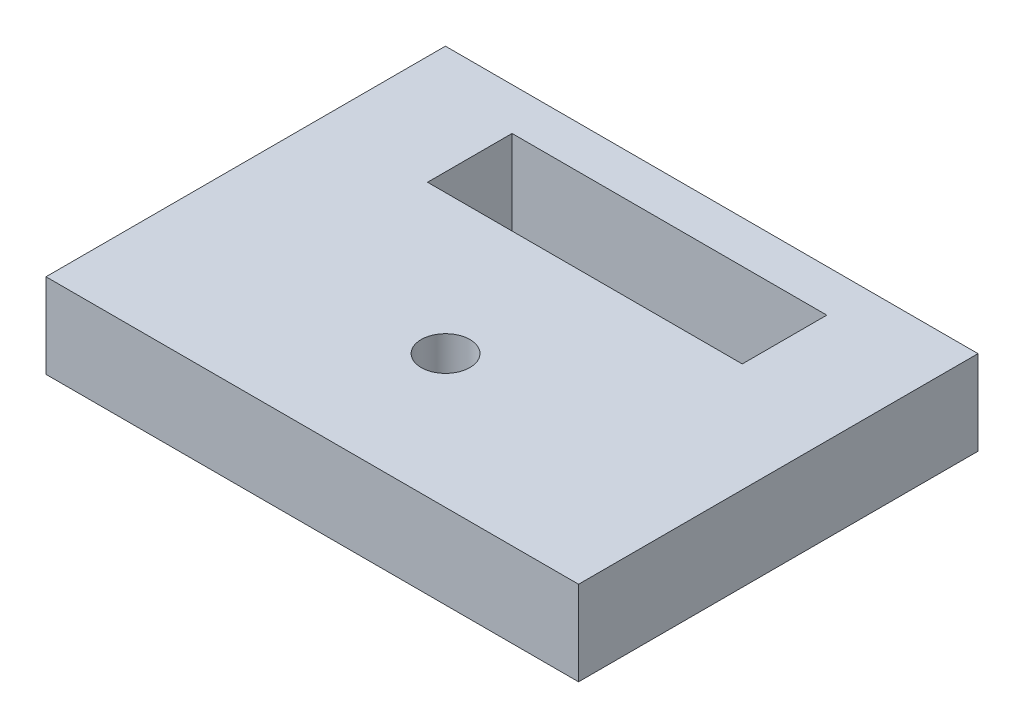
ISO-10303-21;
HEADER;
FILE_DESCRIPTION(('STEP AP214'),'2;1');
FILE_NAME('part.step','',(''),(''),'','','');
FILE_SCHEMA(('AUTOMOTIVE_DESIGN { 1 0 10303 214 1 1 1 1 }'));
ENDSEC;
DATA;
#1=APPLICATION_CONTEXT('core data for automotive mechanical design processes');
#2=APPLICATION_PROTOCOL_DEFINITION('international standard','automotive_design',2000,#1);
#3=PRODUCT_CONTEXT('',#1,'mechanical');
#4=PRODUCT('Part','Part','',(#3));
#5=PRODUCT_RELATED_PRODUCT_CATEGORY('part','',(#4));
#6=PRODUCT_DEFINITION_FORMATION('','',#4);
#7=PRODUCT_DEFINITION_CONTEXT('part definition',#1,'design');
#8=PRODUCT_DEFINITION('design','',#6,#7);
#9=PRODUCT_DEFINITION_SHAPE('','',#8);
#10=(LENGTH_UNIT() NAMED_UNIT(*) SI_UNIT(.MILLI.,.METRE.));
#11=(NAMED_UNIT(*) PLANE_ANGLE_UNIT() SI_UNIT($,.RADIAN.));
#12=(NAMED_UNIT(*) SI_UNIT($,.STERADIAN.) SOLID_ANGLE_UNIT());
#13=UNCERTAINTY_MEASURE_WITH_UNIT(LENGTH_MEASURE(1.E-05),#10,'distance_accuracy_value','');
#14=(GEOMETRIC_REPRESENTATION_CONTEXT(3) GLOBAL_UNCERTAINTY_ASSIGNED_CONTEXT((#13)) GLOBAL_UNIT_ASSIGNED_CONTEXT((#10,
#11,#12)) REPRESENTATION_CONTEXT('',''));
#15=CARTESIAN_POINT('',(0.,0.,0.));
#16=DIRECTION('',(0.,0.,1.));
#17=DIRECTION('',(1.,0.,0.));
#18=AXIS2_PLACEMENT_3D('',#15,#16,#17);
#19=CARTESIAN_POINT('',(-20.,6.35,15.));
#20=DIRECTION('',(0.,0.,-1.));
#21=DIRECTION('',(-1.,0.,0.));
#22=AXIS2_PLACEMENT_3D('',#19,#20,#21);
#23=PLANE('',#22);
#24=DIRECTION('',(1.,0.,0.));
#25=VECTOR('',#24,1.);
#26=CARTESIAN_POINT('',(-20.,0.,15.));
#27=LINE('',#26,#25);
#28=CARTESIAN_POINT('',(-20.,0.,15.));
#29=VERTEX_POINT('',#28);
#30=CARTESIAN_POINT('',(20.,0.,15.));
#31=VERTEX_POINT('',#30);
#32=EDGE_CURVE('E133',#29,#31,#27,.T.);
#33=ORIENTED_EDGE('',*,*,#32,.T.);
#34=DIRECTION('',(0.,-1.,0.));
#35=VECTOR('',#34,1.);
#36=CARTESIAN_POINT('',(20.,6.35,15.));
#37=LINE('',#36,#35);
#38=CARTESIAN_POINT('',(20.,6.35,15.));
#39=VERTEX_POINT('',#38);
#40=EDGE_CURVE('E11',#39,#31,#37,.T.);
#41=ORIENTED_EDGE('',*,*,#40,.F.);
#42=DIRECTION('',(1.,0.,0.));
#43=VECTOR('',#42,1.);
#44=CARTESIAN_POINT('',(-20.,6.35,15.));
#45=LINE('',#44,#43);
#46=CARTESIAN_POINT('',(-20.,6.35,15.));
#47=VERTEX_POINT('',#46);
#48=EDGE_CURVE('E137',#47,#39,#45,.T.);
#49=ORIENTED_EDGE('',*,*,#48,.F.);
#50=DIRECTION('',(0.,-1.,0.));
#51=VECTOR('',#50,1.);
#52=CARTESIAN_POINT('',(-20.,6.35,15.));
#53=LINE('',#52,#51);
#54=EDGE_CURVE('E147',#47,#29,#53,.T.);
#55=ORIENTED_EDGE('',*,*,#54,.T.);
#56=EDGE_LOOP('',(#33,#41,#49,#55));
#57=FACE_BOUND('',#56,.T.);
#58=ADVANCED_FACE('F33',(#57),#23,.F.);
#59=CARTESIAN_POINT('',(20.,6.35,15.));
#60=DIRECTION('',(-1.,0.,0.));
#61=DIRECTION('',(0.,0.,1.));
#62=AXIS2_PLACEMENT_3D('',#59,#60,#61);
#63=PLANE('',#62);
#64=DIRECTION('',(0.,0.,-1.));
#65=VECTOR('',#64,1.);
#66=CARTESIAN_POINT('',(20.,0.,15.));
#67=LINE('',#66,#65);
#68=CARTESIAN_POINT('',(20.,0.,-15.));
#69=VERTEX_POINT('',#68);
#70=EDGE_CURVE('E150',#31,#69,#67,.T.);
#71=ORIENTED_EDGE('',*,*,#70,.T.);
#72=DIRECTION('',(0.,-1.,0.));
#73=VECTOR('',#72,1.);
#74=CARTESIAN_POINT('',(20.,6.35,-15.));
#75=LINE('',#74,#73);
#76=CARTESIAN_POINT('',(20.,6.35,-15.));
#77=VERTEX_POINT('',#76);
#78=EDGE_CURVE('E40',#77,#69,#75,.T.);
#79=ORIENTED_EDGE('',*,*,#78,.F.);
#80=DIRECTION('',(0.,0.,-1.));
#81=VECTOR('',#80,1.);
#82=CARTESIAN_POINT('',(20.,6.35,15.));
#83=LINE('',#82,#81);
#84=EDGE_CURVE('E140',#39,#77,#83,.T.);
#85=ORIENTED_EDGE('',*,*,#84,.F.);
#86=ORIENTED_EDGE('',*,*,#40,.T.);
#87=EDGE_LOOP('',(#71,#79,#85,#86));
#88=FACE_BOUND('',#87,.T.);
#89=ADVANCED_FACE('F178',(#88),#63,.F.);
#90=CARTESIAN_POINT('',(-20.,6.35,-15.));
#91=DIRECTION('',(0.,0.,1.));
#92=DIRECTION('',(1.,0.,0.));
#93=AXIS2_PLACEMENT_3D('',#90,#91,#92);
#94=PLANE('',#93);
#95=DIRECTION('',(-1.,0.,0.));
#96=VECTOR('',#95,1.);
#97=CARTESIAN_POINT('',(-20.,0.,-15.));
#98=LINE('',#97,#96);
#99=CARTESIAN_POINT('',(-20.,0.,-15.));
#100=VERTEX_POINT('',#99);
#101=EDGE_CURVE('E152',#69,#100,#98,.T.);
#102=ORIENTED_EDGE('',*,*,#101,.T.);
#103=DIRECTION('',(0.,-1.,0.));
#104=VECTOR('',#103,1.);
#105=CARTESIAN_POINT('',(-20.,6.35,-15.));
#106=LINE('',#105,#104);
#107=CARTESIAN_POINT('',(-20.,6.35,-15.));
#108=VERTEX_POINT('',#107);
#109=EDGE_CURVE('E157',#108,#100,#106,.T.);
#110=ORIENTED_EDGE('',*,*,#109,.F.);
#111=DIRECTION('',(-1.,0.,0.));
#112=VECTOR('',#111,1.);
#113=CARTESIAN_POINT('',(-20.,6.35,-15.));
#114=LINE('',#113,#112);
#115=EDGE_CURVE('E143',#77,#108,#114,.T.);
#116=ORIENTED_EDGE('',*,*,#115,.F.);
#117=ORIENTED_EDGE('',*,*,#78,.T.);
#118=EDGE_LOOP('',(#102,#110,#116,#117));
#119=FACE_BOUND('',#118,.T.);
#120=ADVANCED_FACE('F164',(#119),#94,.F.);
#121=CARTESIAN_POINT('',(-20.,6.35,15.));
#122=DIRECTION('',(1.,0.,0.));
#123=DIRECTION('',(0.,0.,-1.));
#124=AXIS2_PLACEMENT_3D('',#121,#122,#123);
#125=PLANE('',#124);
#126=DIRECTION('',(0.,0.,1.));
#127=VECTOR('',#126,1.);
#128=CARTESIAN_POINT('',(-20.,0.,15.));
#129=LINE('',#128,#127);
#130=EDGE_CURVE('E141',#100,#29,#129,.T.);
#131=ORIENTED_EDGE('',*,*,#130,.T.);
#132=ORIENTED_EDGE('',*,*,#54,.F.);
#133=DIRECTION('',(0.,0.,1.));
#134=VECTOR('',#133,1.);
#135=CARTESIAN_POINT('',(-20.,6.35,15.));
#136=LINE('',#135,#134);
#137=EDGE_CURVE('E145',#108,#47,#136,.T.);
#138=ORIENTED_EDGE('',*,*,#137,.F.);
#139=ORIENTED_EDGE('',*,*,#109,.T.);
#140=EDGE_LOOP('',(#131,#132,#138,#139));
#141=FACE_BOUND('',#140,.T.);
#142=ADVANCED_FACE('F171',(#141),#125,.F.);
#143=CARTESIAN_POINT('',(0.,6.35,0.));
#144=DIRECTION('',(0.,1.,0.));
#145=DIRECTION('',(0.,0.,1.));
#146=AXIS2_PLACEMENT_3D('',#143,#144,#145);
#147=PLANE('',#146);
#148=CARTESIAN_POINT('',(0.,6.35,4.98979999999999));
#149=DIRECTION('',(0.,1.,0.));
#150=DIRECTION('',(0.,0.,1.));
#151=AXIS2_PLACEMENT_3D('',#148,#149,#150);
#152=CIRCLE('',#151,1.82879999999999);
#153=CARTESIAN_POINT('',(0.,6.35,6.81859999999998));
#154=VERTEX_POINT('',#153);
#155=EDGE_CURVE('E215',#154,#154,#152,.T.);
#156=ORIENTED_EDGE('',*,*,#155,.F.);
#157=EDGE_LOOP('',(#156));
#158=FACE_BOUND('',#157,.T.);
#159=DIRECTION('',(1.,0.,0.));
#160=VECTOR('',#159,1.);
#161=CARTESIAN_POINT('',(-11.82,6.35,-5.47500000000001));
#162=LINE('',#161,#160);
#163=CARTESIAN_POINT('',(-11.82,6.35,-5.47500000000001));
#164=VERTEX_POINT('',#163);
#165=CARTESIAN_POINT('',(11.82,6.35,-5.47500000000001));
#166=VERTEX_POINT('',#165);
#167=EDGE_CURVE('E47',#164,#166,#162,.T.);
#168=ORIENTED_EDGE('',*,*,#167,.F.);
#169=DIRECTION('',(0.,0.,1.));
#170=VECTOR('',#169,1.);
#171=CARTESIAN_POINT('',(-11.82,6.35,-5.47500000000001));
#172=LINE('',#171,#170);
#173=CARTESIAN_POINT('',(-11.82,6.35,-11.825));
#174=VERTEX_POINT('',#173);
#175=EDGE_CURVE('E115',#174,#164,#172,.T.);
#176=ORIENTED_EDGE('',*,*,#175,.F.);
#177=DIRECTION('',(-1.,0.,0.));
#178=VECTOR('',#177,1.);
#179=CARTESIAN_POINT('',(-11.82,6.35,-11.825));
#180=LINE('',#179,#178);
#181=CARTESIAN_POINT('',(11.82,6.35,-11.825));
#182=VERTEX_POINT('',#181);
#183=EDGE_CURVE('E118',#182,#174,#180,.T.);
#184=ORIENTED_EDGE('',*,*,#183,.F.);
#185=DIRECTION('',(0.,0.,-1.));
#186=VECTOR('',#185,1.);
#187=CARTESIAN_POINT('',(11.82,6.35,-5.47500000000001));
#188=LINE('',#187,#186);
#189=EDGE_CURVE('E127',#166,#182,#188,.T.);
#190=ORIENTED_EDGE('',*,*,#189,.F.);
#191=EDGE_LOOP('',(#168,#176,#184,#190));
#192=FACE_BOUND('',#191,.T.);
#193=ORIENTED_EDGE('',*,*,#48,.T.);
#194=ORIENTED_EDGE('',*,*,#84,.T.);
#195=ORIENTED_EDGE('',*,*,#115,.T.);
#196=ORIENTED_EDGE('',*,*,#137,.T.);
#197=EDGE_LOOP('',(#193,#194,#195,#196));
#198=FACE_BOUND('',#197,.T.);
#199=ADVANCED_FACE('F177',(#158,#192,#198),#147,.T.);
#200=CARTESIAN_POINT('',(0.,0.,0.));
#201=DIRECTION('',(0.,1.,0.));
#202=DIRECTION('',(0.,0.,1.));
#203=AXIS2_PLACEMENT_3D('',#200,#201,#202);
#204=PLANE('',#203);
#205=CARTESIAN_POINT('',(0.,0.,4.98979999999999));
#206=DIRECTION('',(0.,1.,0.));
#207=DIRECTION('',(0.,0.,1.));
#208=AXIS2_PLACEMENT_3D('',#205,#206,#207);
#209=CIRCLE('',#208,1.82879999999999);
#210=CARTESIAN_POINT('',(0.,0.,6.81859999999998));
#211=VERTEX_POINT('',#210);
#212=EDGE_CURVE('E121',#211,#211,#209,.T.);
#213=ORIENTED_EDGE('',*,*,#212,.T.);
#214=EDGE_LOOP('',(#213));
#215=FACE_BOUND('',#214,.T.);
#216=DIRECTION('',(0.,0.,1.));
#217=VECTOR('',#216,1.);
#218=CARTESIAN_POINT('',(-11.82,0.,-5.47500000000001));
#219=LINE('',#218,#217);
#220=CARTESIAN_POINT('',(-11.82,0.,-11.825));
#221=VERTEX_POINT('',#220);
#222=CARTESIAN_POINT('',(-11.82,0.,-5.47500000000001));
#223=VERTEX_POINT('',#222);
#224=EDGE_CURVE('E105',#221,#223,#219,.T.);
#225=ORIENTED_EDGE('',*,*,#224,.T.);
#226=DIRECTION('',(1.,0.,0.));
#227=VECTOR('',#226,1.);
#228=CARTESIAN_POINT('',(-11.82,0.,-5.47500000000001));
#229=LINE('',#228,#227);
#230=CARTESIAN_POINT('',(11.82,0.,-5.47500000000001));
#231=VERTEX_POINT('',#230);
#232=EDGE_CURVE('E99',#223,#231,#229,.T.);
#233=ORIENTED_EDGE('',*,*,#232,.T.);
#234=DIRECTION('',(0.,0.,-1.));
#235=VECTOR('',#234,1.);
#236=CARTESIAN_POINT('',(11.82,0.,-5.47500000000001));
#237=LINE('',#236,#235);
#238=CARTESIAN_POINT('',(11.82,0.,-11.825));
#239=VERTEX_POINT('',#238);
#240=EDGE_CURVE('E108',#231,#239,#237,.T.);
#241=ORIENTED_EDGE('',*,*,#240,.T.);
#242=DIRECTION('',(-1.,0.,0.));
#243=VECTOR('',#242,1.);
#244=CARTESIAN_POINT('',(-11.82,0.,-11.825));
#245=LINE('',#244,#243);
#246=EDGE_CURVE('E55',#239,#221,#245,.T.);
#247=ORIENTED_EDGE('',*,*,#246,.T.);
#248=EDGE_LOOP('',(#225,#233,#241,#247));
#249=FACE_BOUND('',#248,.T.);
#250=ORIENTED_EDGE('',*,*,#32,.F.);
#251=ORIENTED_EDGE('',*,*,#130,.F.);
#252=ORIENTED_EDGE('',*,*,#101,.F.);
#253=ORIENTED_EDGE('',*,*,#70,.F.);
#254=EDGE_LOOP('',(#250,#251,#252,#253));
#255=FACE_BOUND('',#254,.T.);
#256=ADVANCED_FACE('F112',(#215,#249,#255),#204,.F.);
#257=CARTESIAN_POINT('',(-11.82,0.,-5.47500000000001));
#258=DIRECTION('',(0.,0.,1.));
#259=DIRECTION('',(1.,0.,0.));
#260=AXIS2_PLACEMENT_3D('',#257,#258,#259);
#261=PLANE('',#260);
#262=ORIENTED_EDGE('',*,*,#167,.T.);
#263=DIRECTION('',(0.,1.,0.));
#264=VECTOR('',#263,1.);
#265=CARTESIAN_POINT('',(11.82,0.,-5.47500000000001));
#266=LINE('',#265,#264);
#267=EDGE_CURVE('E95',#231,#166,#266,.T.);
#268=ORIENTED_EDGE('',*,*,#267,.F.);
#269=ORIENTED_EDGE('',*,*,#232,.F.);
#270=DIRECTION('',(0.,1.,0.));
#271=VECTOR('',#270,1.);
#272=CARTESIAN_POINT('',(-11.82,0.,-5.47500000000001));
#273=LINE('',#272,#271);
#274=EDGE_CURVE('E131',#223,#164,#273,.T.);
#275=ORIENTED_EDGE('',*,*,#274,.T.);
#276=EDGE_LOOP('',(#262,#268,#269,#275));
#277=FACE_BOUND('',#276,.T.);
#278=ADVANCED_FACE('F97',(#277),#261,.F.);
#279=CARTESIAN_POINT('',(-11.82,0.,-5.47500000000001));
#280=DIRECTION('',(-1.,0.,0.));
#281=DIRECTION('',(0.,0.,1.));
#282=AXIS2_PLACEMENT_3D('',#279,#280,#281);
#283=PLANE('',#282);
#284=ORIENTED_EDGE('',*,*,#175,.T.);
#285=ORIENTED_EDGE('',*,*,#274,.F.);
#286=ORIENTED_EDGE('',*,*,#224,.F.);
#287=DIRECTION('',(0.,1.,0.));
#288=VECTOR('',#287,1.);
#289=CARTESIAN_POINT('',(-11.82,0.,-11.825));
#290=LINE('',#289,#288);
#291=EDGE_CURVE('E134',#221,#174,#290,.T.);
#292=ORIENTED_EDGE('',*,*,#291,.T.);
#293=EDGE_LOOP('',(#284,#285,#286,#292));
#294=FACE_BOUND('',#293,.T.);
#295=ADVANCED_FACE('F196',(#294),#283,.F.);
#296=CARTESIAN_POINT('',(-11.82,0.,-11.825));
#297=DIRECTION('',(0.,0.,-1.));
#298=DIRECTION('',(-1.,0.,0.));
#299=AXIS2_PLACEMENT_3D('',#296,#297,#298);
#300=PLANE('',#299);
#301=ORIENTED_EDGE('',*,*,#183,.T.);
#302=ORIENTED_EDGE('',*,*,#291,.F.);
#303=ORIENTED_EDGE('',*,*,#246,.F.);
#304=DIRECTION('',(0.,1.,0.));
#305=VECTOR('',#304,1.);
#306=CARTESIAN_POINT('',(11.82,0.,-11.825));
#307=LINE('',#306,#305);
#308=EDGE_CURVE('E104',#239,#182,#307,.T.);
#309=ORIENTED_EDGE('',*,*,#308,.T.);
#310=EDGE_LOOP('',(#301,#302,#303,#309));
#311=FACE_BOUND('',#310,.T.);
#312=ADVANCED_FACE('F200',(#311),#300,.F.);
#313=CARTESIAN_POINT('',(11.82,0.,-5.47500000000001));
#314=DIRECTION('',(1.,0.,0.));
#315=DIRECTION('',(0.,0.,-1.));
#316=AXIS2_PLACEMENT_3D('',#313,#314,#315);
#317=PLANE('',#316);
#318=ORIENTED_EDGE('',*,*,#189,.T.);
#319=ORIENTED_EDGE('',*,*,#308,.F.);
#320=ORIENTED_EDGE('',*,*,#240,.F.);
#321=ORIENTED_EDGE('',*,*,#267,.T.);
#322=EDGE_LOOP('',(#318,#319,#320,#321));
#323=FACE_BOUND('',#322,.T.);
#324=ADVANCED_FACE('F109',(#323),#317,.F.);
#325=CARTESIAN_POINT('',(0.,6.35,4.98979999999999));
#326=DIRECTION('',(0.,1.,0.));
#327=DIRECTION('',(0.,0.,1.));
#328=AXIS2_PLACEMENT_3D('',#325,#326,#327);
#329=CYLINDRICAL_SURFACE('',#328,1.82879999999999);
#330=ORIENTED_EDGE('',*,*,#212,.F.);
#331=EDGE_LOOP('',(#330));
#332=FACE_BOUND('',#331,.T.);
#333=ORIENTED_EDGE('',*,*,#155,.T.);
#334=EDGE_LOOP('',(#333));
#335=FACE_BOUND('',#334,.T.);
#336=ADVANCED_FACE('F199',(#332,#335),#329,.F.);
#337=CLOSED_SHELL('',(#58,#89,#120,#142,#199,#256,#278,#295,#312,#324,#336));
#338=MANIFOLD_SOLID_BREP('B2',#337);
#339=ADVANCED_BREP_SHAPE_REPRESENTATION('',(#18,#338),#14);
#340=SHAPE_DEFINITION_REPRESENTATION(#9,#339);
ENDSEC;
END-ISO-10303-21;
